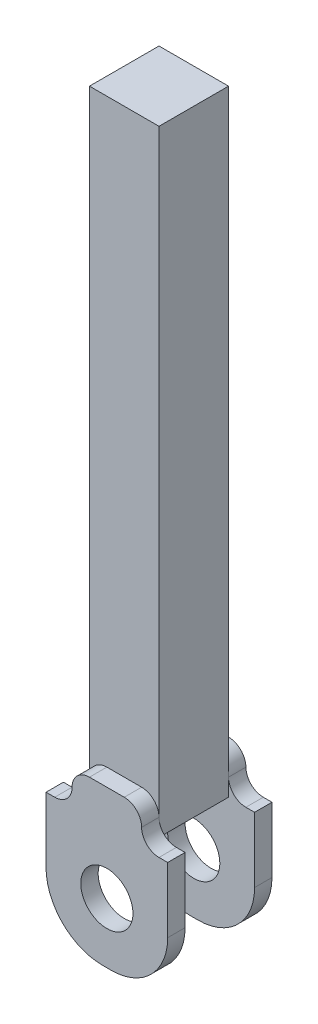
ISO-10303-21;
HEADER;
FILE_DESCRIPTION(('STEP AP214'),'2;1');
FILE_NAME('part.step','',(''),(''),'','','');
FILE_SCHEMA(('AUTOMOTIVE_DESIGN { 1 0 10303 214 1 1 1 1 }'));
ENDSEC;
DATA;
#1=APPLICATION_CONTEXT('core data for automotive mechanical design processes');
#2=APPLICATION_PROTOCOL_DEFINITION('international standard','automotive_design',2000,#1);
#3=PRODUCT_CONTEXT('',#1,'mechanical');
#4=PRODUCT('Part','Part','',(#3));
#5=PRODUCT_RELATED_PRODUCT_CATEGORY('part','',(#4));
#6=PRODUCT_DEFINITION_FORMATION('','',#4);
#7=PRODUCT_DEFINITION_CONTEXT('part definition',#1,'design');
#8=PRODUCT_DEFINITION('design','',#6,#7);
#9=PRODUCT_DEFINITION_SHAPE('','',#8);
#10=(LENGTH_UNIT() NAMED_UNIT(*) SI_UNIT(.MILLI.,.METRE.));
#11=(NAMED_UNIT(*) PLANE_ANGLE_UNIT() SI_UNIT($,.RADIAN.));
#12=(NAMED_UNIT(*) SI_UNIT($,.STERADIAN.) SOLID_ANGLE_UNIT());
#13=UNCERTAINTY_MEASURE_WITH_UNIT(LENGTH_MEASURE(1.E-05),#10,'distance_accuracy_value','');
#14=(GEOMETRIC_REPRESENTATION_CONTEXT(3) GLOBAL_UNCERTAINTY_ASSIGNED_CONTEXT((#13)) GLOBAL_UNIT_ASSIGNED_CONTEXT((#10,
#11,#12)) REPRESENTATION_CONTEXT('',''));
#15=CARTESIAN_POINT('',(0.,0.,0.));
#16=DIRECTION('',(0.,0.,1.));
#17=DIRECTION('',(1.,0.,0.));
#18=AXIS2_PLACEMENT_3D('',#15,#16,#17);
#19=CARTESIAN_POINT('',(-25.4,450.,25.4));
#20=DIRECTION('',(0.,0.,-1.));
#21=DIRECTION('',(-1.,0.,0.));
#22=AXIS2_PLACEMENT_3D('',#19,#20,#21);
#23=PLANE('',#22);
#24=DIRECTION('',(-1.,0.,0.));
#25=VECTOR('',#24,1.);
#26=CARTESIAN_POINT('',(-25.4,25.4,25.4));
#27=LINE('',#26,#25);
#28=CARTESIAN_POINT('',(12.7,25.4,25.4));
#29=VERTEX_POINT('',#28);
#30=CARTESIAN_POINT('',(-12.7,25.4,25.4));
#31=VERTEX_POINT('',#30);
#32=EDGE_CURVE('E315',#29,#31,#27,.T.);
#33=ORIENTED_EDGE('',*,*,#32,.F.);
#34=CARTESIAN_POINT('',(12.7,12.7,25.4));
#35=DIRECTION('',(0.,0.,-1.));
#36=DIRECTION('',(-1.,0.,0.));
#37=AXIS2_PLACEMENT_3D('',#34,#35,#36);
#38=CIRCLE('',#37,12.7);
#39=CARTESIAN_POINT('',(25.4,12.7,25.4));
#40=VERTEX_POINT('',#39);
#41=EDGE_CURVE('E392',#29,#40,#38,.T.);
#42=ORIENTED_EDGE('',*,*,#41,.T.);
#43=DIRECTION('',(0.,-1.,0.));
#44=VECTOR('',#43,1.);
#45=CARTESIAN_POINT('',(25.4,450.,25.4));
#46=LINE('',#45,#44);
#47=CARTESIAN_POINT('',(25.4,450.,25.4));
#48=VERTEX_POINT('',#47);
#49=EDGE_CURVE('E335',#48,#40,#46,.T.);
#50=ORIENTED_EDGE('',*,*,#49,.F.);
#51=DIRECTION('',(1.,0.,0.));
#52=VECTOR('',#51,1.);
#53=CARTESIAN_POINT('',(-25.4,450.,25.4));
#54=LINE('',#53,#52);
#55=CARTESIAN_POINT('',(-25.4,450.,25.4));
#56=VERTEX_POINT('',#55);
#57=EDGE_CURVE('E333',#56,#48,#54,.T.);
#58=ORIENTED_EDGE('',*,*,#57,.F.);
#59=DIRECTION('',(0.,-1.,0.));
#60=VECTOR('',#59,1.);
#61=CARTESIAN_POINT('',(-25.4,450.,25.4));
#62=LINE('',#61,#60);
#63=CARTESIAN_POINT('',(-25.4,12.7,25.4));
#64=VERTEX_POINT('',#63);
#65=EDGE_CURVE('E347',#56,#64,#62,.T.);
#66=ORIENTED_EDGE('',*,*,#65,.T.);
#67=CARTESIAN_POINT('',(-12.7,12.7,25.4));
#68=DIRECTION('',(0.,0.,-1.));
#69=DIRECTION('',(-1.,0.,0.));
#70=AXIS2_PLACEMENT_3D('',#67,#68,#69);
#71=CIRCLE('',#70,12.7);
#72=EDGE_CURVE('E404',#64,#31,#71,.T.);
#73=ORIENTED_EDGE('',*,*,#72,.T.);
#74=EDGE_LOOP('',(#33,#42,#50,#58,#66,#73));
#75=FACE_BOUND('',#74,.T.);
#76=ADVANCED_FACE('F37',(#75),#23,.F.);
#77=CARTESIAN_POINT('',(25.4,450.,25.4));
#78=DIRECTION('',(-1.,0.,0.));
#79=DIRECTION('',(0.,0.,1.));
#80=AXIS2_PLACEMENT_3D('',#77,#78,#79);
#81=PLANE('',#80);
#82=ORIENTED_EDGE('',*,*,#49,.T.);
#83=DIRECTION('',(0.,-1.,0.));
#84=VECTOR('',#83,1.);
#85=CARTESIAN_POINT('',(25.4,0.,25.4));
#86=LINE('',#85,#84);
#87=CARTESIAN_POINT('',(25.4,0.,25.4));
#88=VERTEX_POINT('',#87);
#89=EDGE_CURVE('E356',#40,#88,#86,.T.);
#90=ORIENTED_EDGE('',*,*,#89,.T.);
#91=DIRECTION('',(0.,0.,-1.));
#92=VECTOR('',#91,1.);
#93=CARTESIAN_POINT('',(25.4,0.,25.4));
#94=LINE('',#93,#92);
#95=CARTESIAN_POINT('',(25.4,0.,-25.4));
#96=VERTEX_POINT('',#95);
#97=EDGE_CURVE('E324',#88,#96,#94,.T.);
#98=ORIENTED_EDGE('',*,*,#97,.T.);
#99=DIRECTION('',(0.,1.,0.));
#100=VECTOR('',#99,1.);
#101=CARTESIAN_POINT('',(25.4,0.,-25.4));
#102=LINE('',#101,#100);
#103=CARTESIAN_POINT('',(25.4,12.7,-25.4));
#104=VERTEX_POINT('',#103);
#105=EDGE_CURVE('E353',#96,#104,#102,.T.);
#106=ORIENTED_EDGE('',*,*,#105,.T.);
#107=DIRECTION('',(0.,-1.,0.));
#108=VECTOR('',#107,1.);
#109=CARTESIAN_POINT('',(25.4,450.,-25.4));
#110=LINE('',#109,#108);
#111=CARTESIAN_POINT('',(25.4,450.,-25.4));
#112=VERTEX_POINT('',#111);
#113=EDGE_CURVE('E351',#112,#104,#110,.T.);
#114=ORIENTED_EDGE('',*,*,#113,.F.);
#115=DIRECTION('',(0.,0.,-1.));
#116=VECTOR('',#115,1.);
#117=CARTESIAN_POINT('',(25.4,450.,25.4));
#118=LINE('',#117,#116);
#119=EDGE_CURVE('E325',#48,#112,#118,.T.);
#120=ORIENTED_EDGE('',*,*,#119,.F.);
#121=EDGE_LOOP('',(#82,#90,#98,#106,#114,#120));
#122=FACE_BOUND('',#121,.T.);
#123=ADVANCED_FACE('F526',(#122),#81,.F.);
#124=CARTESIAN_POINT('',(-25.4,450.,-25.4));
#125=DIRECTION('',(0.,0.,1.));
#126=DIRECTION('',(1.,0.,0.));
#127=AXIS2_PLACEMENT_3D('',#124,#125,#126);
#128=PLANE('',#127);
#129=ORIENTED_EDGE('',*,*,#113,.T.);
#130=CARTESIAN_POINT('',(12.7,12.7,-25.4));
#131=DIRECTION('',(0.,0.,1.));
#132=DIRECTION('',(1.,0.,0.));
#133=AXIS2_PLACEMENT_3D('',#130,#131,#132);
#134=CIRCLE('',#133,12.7);
#135=CARTESIAN_POINT('',(12.7,25.4,-25.4));
#136=VERTEX_POINT('',#135);
#137=EDGE_CURVE('E390',#104,#136,#134,.T.);
#138=ORIENTED_EDGE('',*,*,#137,.T.);
#139=DIRECTION('',(-1.,0.,0.));
#140=VECTOR('',#139,1.);
#141=CARTESIAN_POINT('',(-25.4,25.4,-25.4));
#142=LINE('',#141,#140);
#143=CARTESIAN_POINT('',(-12.7,25.4,-25.4));
#144=VERTEX_POINT('',#143);
#145=EDGE_CURVE('E275',#136,#144,#142,.T.);
#146=ORIENTED_EDGE('',*,*,#145,.T.);
#147=CARTESIAN_POINT('',(-12.7,12.7,-25.4));
#148=DIRECTION('',(0.,0.,1.));
#149=DIRECTION('',(1.,0.,0.));
#150=AXIS2_PLACEMENT_3D('',#147,#148,#149);
#151=CIRCLE('',#150,12.7);
#152=CARTESIAN_POINT('',(-25.4,12.7,-25.4));
#153=VERTEX_POINT('',#152);
#154=EDGE_CURVE('E406',#144,#153,#151,.T.);
#155=ORIENTED_EDGE('',*,*,#154,.T.);
#156=DIRECTION('',(0.,-1.,0.));
#157=VECTOR('',#156,1.);
#158=CARTESIAN_POINT('',(-25.4,450.,-25.4));
#159=LINE('',#158,#157);
#160=CARTESIAN_POINT('',(-25.4,450.,-25.4));
#161=VERTEX_POINT('',#160);
#162=EDGE_CURVE('E349',#161,#153,#159,.T.);
#163=ORIENTED_EDGE('',*,*,#162,.F.);
#164=DIRECTION('',(-1.,0.,0.));
#165=VECTOR('',#164,1.);
#166=CARTESIAN_POINT('',(-25.4,450.,-25.4));
#167=LINE('',#166,#165);
#168=EDGE_CURVE('E328',#112,#161,#167,.T.);
#169=ORIENTED_EDGE('',*,*,#168,.F.);
#170=EDGE_LOOP('',(#129,#138,#146,#155,#163,#169));
#171=FACE_BOUND('',#170,.T.);
#172=ADVANCED_FACE('F531',(#171),#128,.F.);
#173=CARTESIAN_POINT('',(-25.4,450.,25.4));
#174=DIRECTION('',(1.,0.,0.));
#175=DIRECTION('',(0.,0.,-1.));
#176=AXIS2_PLACEMENT_3D('',#173,#174,#175);
#177=PLANE('',#176);
#178=ORIENTED_EDGE('',*,*,#162,.T.);
#179=DIRECTION('',(0.,-1.,0.));
#180=VECTOR('',#179,1.);
#181=CARTESIAN_POINT('',(-25.4,0.,-25.4));
#182=LINE('',#181,#180);
#183=CARTESIAN_POINT('',(-25.4,0.,-25.4));
#184=VERTEX_POINT('',#183);
#185=EDGE_CURVE('E385',#153,#184,#182,.T.);
#186=ORIENTED_EDGE('',*,*,#185,.T.);
#187=DIRECTION('',(0.,0.,1.));
#188=VECTOR('',#187,1.);
#189=CARTESIAN_POINT('',(-25.4,0.,25.4));
#190=LINE('',#189,#188);
#191=CARTESIAN_POINT('',(-25.4,0.,25.4));
#192=VERTEX_POINT('',#191);
#193=EDGE_CURVE('E341',#184,#192,#190,.T.);
#194=ORIENTED_EDGE('',*,*,#193,.T.);
#195=DIRECTION('',(0.,1.,0.));
#196=VECTOR('',#195,1.);
#197=CARTESIAN_POINT('',(-25.4,0.,25.4));
#198=LINE('',#197,#196);
#199=EDGE_CURVE('E382',#192,#64,#198,.T.);
#200=ORIENTED_EDGE('',*,*,#199,.T.);
#201=ORIENTED_EDGE('',*,*,#65,.F.);
#202=DIRECTION('',(0.,0.,1.));
#203=VECTOR('',#202,1.);
#204=CARTESIAN_POINT('',(-25.4,450.,25.4));
#205=LINE('',#204,#203);
#206=EDGE_CURVE('E331',#161,#56,#205,.T.);
#207=ORIENTED_EDGE('',*,*,#206,.F.);
#208=EDGE_LOOP('',(#178,#186,#194,#200,#201,#207));
#209=FACE_BOUND('',#208,.T.);
#210=ADVANCED_FACE('F538',(#209),#177,.F.);
#211=CARTESIAN_POINT('',(0.,450.,0.));
#212=DIRECTION('',(0.,-1.,0.));
#213=DIRECTION('',(0.,0.,-1.));
#214=AXIS2_PLACEMENT_3D('',#211,#212,#213);
#215=PLANE('',#214);
#216=ORIENTED_EDGE('',*,*,#119,.T.);
#217=ORIENTED_EDGE('',*,*,#168,.T.);
#218=ORIENTED_EDGE('',*,*,#206,.T.);
#219=ORIENTED_EDGE('',*,*,#57,.T.);
#220=EDGE_LOOP('',(#216,#217,#218,#219));
#221=FACE_BOUND('',#220,.T.);
#222=ADVANCED_FACE('F541',(#221),#215,.F.);
#223=CARTESIAN_POINT('',(0.,0.,0.));
#224=DIRECTION('',(0.,-1.,0.));
#225=DIRECTION('',(0.,0.,-1.));
#226=AXIS2_PLACEMENT_3D('',#223,#224,#225);
#227=PLANE('',#226);
#228=ORIENTED_EDGE('',*,*,#97,.F.);
#229=DIRECTION('',(1.,0.,0.));
#230=VECTOR('',#229,1.);
#231=CARTESIAN_POINT('',(-25.4,0.,25.4));
#232=LINE('',#231,#230);
#233=EDGE_CURVE('E329',#192,#88,#232,.T.);
#234=ORIENTED_EDGE('',*,*,#233,.F.);
#235=ORIENTED_EDGE('',*,*,#193,.F.);
#236=DIRECTION('',(-1.,0.,0.));
#237=VECTOR('',#236,1.);
#238=CARTESIAN_POINT('',(-25.4,0.,-25.4));
#239=LINE('',#238,#237);
#240=EDGE_CURVE('E338',#96,#184,#239,.T.);
#241=ORIENTED_EDGE('',*,*,#240,.F.);
#242=EDGE_LOOP('',(#228,#234,#235,#241));
#243=FACE_BOUND('',#242,.T.);
#244=ADVANCED_FACE('F536',(#243),#227,.T.);
#245=CARTESIAN_POINT('',(0.,0.,25.4));
#246=DIRECTION('',(0.,0.,1.));
#247=DIRECTION('',(1.,0.,0.));
#248=AXIS2_PLACEMENT_3D('',#245,#246,#247);
#249=PLANE('',#248);
#250=CARTESIAN_POINT('',(0.,-45.,25.4));
#251=DIRECTION('',(0.,0.,1.));
#252=DIRECTION('',(1.,0.,0.));
#253=AXIS2_PLACEMENT_3D('',#250,#251,#252);
#254=CIRCLE('',#253,19.05);
#255=CARTESIAN_POINT('',(19.05,-45.,25.4));
#256=VERTEX_POINT('',#255);
#257=EDGE_CURVE('E245',#256,#256,#254,.T.);
#258=ORIENTED_EDGE('',*,*,#257,.T.);
#259=EDGE_LOOP('',(#258));
#260=FACE_BOUND('',#259,.T.);
#261=DIRECTION('',(1.,0.,0.));
#262=VECTOR('',#261,1.);
#263=CARTESIAN_POINT('',(-44.45,-88.9,25.4));
#264=LINE('',#263,#262);
#265=CARTESIAN_POINT('',(-3.17500000000001,-88.9,25.4));
#266=VERTEX_POINT('',#265);
#267=CARTESIAN_POINT('',(3.17500000000001,-88.9,25.4));
#268=VERTEX_POINT('',#267);
#269=EDGE_CURVE('E307',#266,#268,#264,.T.);
#270=ORIENTED_EDGE('',*,*,#269,.F.);
#271=CARTESIAN_POINT('',(-3.17500000000001,-47.625,25.4));
#272=DIRECTION('',(0.,0.,1.));
#273=DIRECTION('',(1.,0.,0.));
#274=AXIS2_PLACEMENT_3D('',#271,#272,#273);
#275=CIRCLE('',#274,41.275);
#276=CARTESIAN_POINT('',(-44.45,-47.625,25.4));
#277=VERTEX_POINT('',#276);
#278=EDGE_CURVE('E451',#266,#277,#275,.F.);
#279=ORIENTED_EDGE('',*,*,#278,.T.);
#280=DIRECTION('',(0.,-1.,0.));
#281=VECTOR('',#280,1.);
#282=CARTESIAN_POINT('',(-44.45,0.,25.4));
#283=LINE('',#282,#281);
#284=CARTESIAN_POINT('',(-44.45,0.,25.4));
#285=VERTEX_POINT('',#284);
#286=EDGE_CURVE('E287',#285,#277,#283,.T.);
#287=ORIENTED_EDGE('',*,*,#286,.F.);
#288=DIRECTION('',(-1.,0.,0.));
#289=VECTOR('',#288,1.);
#290=CARTESIAN_POINT('',(-44.45,0.,25.4));
#291=LINE('',#290,#289);
#292=CARTESIAN_POINT('',(-38.1,0.,25.4));
#293=VERTEX_POINT('',#292);
#294=EDGE_CURVE('E293',#293,#285,#291,.T.);
#295=ORIENTED_EDGE('',*,*,#294,.F.);
#296=CARTESIAN_POINT('',(-38.1,12.7,25.4));
#297=DIRECTION('',(0.,0.,1.));
#298=DIRECTION('',(1.,0.,0.));
#299=AXIS2_PLACEMENT_3D('',#296,#297,#298);
#300=CIRCLE('',#299,12.7);
#301=EDGE_CURVE('E413',#293,#64,#300,.T.);
#302=ORIENTED_EDGE('',*,*,#301,.T.);
#303=ORIENTED_EDGE('',*,*,#199,.F.);
#304=ORIENTED_EDGE('',*,*,#233,.T.);
#305=ORIENTED_EDGE('',*,*,#89,.F.);
#306=CARTESIAN_POINT('',(38.1,12.7,25.4));
#307=DIRECTION('',(0.,0.,1.));
#308=DIRECTION('',(1.,0.,0.));
#309=AXIS2_PLACEMENT_3D('',#306,#307,#308);
#310=CIRCLE('',#309,12.7);
#311=CARTESIAN_POINT('',(38.1,0.,25.4));
#312=VERTEX_POINT('',#311);
#313=EDGE_CURVE('E395',#40,#312,#310,.T.);
#314=ORIENTED_EDGE('',*,*,#313,.T.);
#315=DIRECTION('',(-1.,0.,0.));
#316=VECTOR('',#315,1.);
#317=CARTESIAN_POINT('',(25.4,0.,25.4));
#318=LINE('',#317,#316);
#319=CARTESIAN_POINT('',(44.45,0.,25.4));
#320=VERTEX_POINT('',#319);
#321=EDGE_CURVE('E312',#320,#312,#318,.T.);
#322=ORIENTED_EDGE('',*,*,#321,.F.);
#323=DIRECTION('',(0.,1.,0.));
#324=VECTOR('',#323,1.);
#325=CARTESIAN_POINT('',(44.45,0.,25.4));
#326=LINE('',#325,#324);
#327=CARTESIAN_POINT('',(44.45,-47.625,25.4));
#328=VERTEX_POINT('',#327);
#329=EDGE_CURVE('E310',#328,#320,#326,.T.);
#330=ORIENTED_EDGE('',*,*,#329,.F.);
#331=CARTESIAN_POINT('',(3.17500000000001,-47.625,25.4));
#332=DIRECTION('',(0.,0.,1.));
#333=DIRECTION('',(1.,0.,0.));
#334=AXIS2_PLACEMENT_3D('',#331,#332,#333);
#335=CIRCLE('',#334,41.275);
#336=EDGE_CURVE('E449',#328,#268,#335,.F.);
#337=ORIENTED_EDGE('',*,*,#336,.T.);
#338=EDGE_LOOP('',(#270,#279,#287,#295,#302,#303,#304,#305,#314,#322,#330,#337));
#339=FACE_BOUND('',#338,.T.);
#340=ADVANCED_FACE('F466',(#260,#339),#249,.F.);
#341=CARTESIAN_POINT('',(0.,0.,38.1));
#342=DIRECTION('',(0.,0.,1.));
#343=DIRECTION('',(1.,0.,0.));
#344=AXIS2_PLACEMENT_3D('',#341,#342,#343);
#345=PLANE('',#344);
#346=DIRECTION('',(0.,-1.,0.));
#347=VECTOR('',#346,1.);
#348=CARTESIAN_POINT('',(-44.45,0.,38.1));
#349=LINE('',#348,#347);
#350=CARTESIAN_POINT('',(-44.45,0.,38.1));
#351=VERTEX_POINT('',#350);
#352=CARTESIAN_POINT('',(-44.45,-47.625,38.1));
#353=VERTEX_POINT('',#352);
#354=EDGE_CURVE('E290',#351,#353,#349,.T.);
#355=ORIENTED_EDGE('',*,*,#354,.T.);
#356=CARTESIAN_POINT('',(-3.17500000000001,-47.625,38.1));
#357=DIRECTION('',(0.,0.,1.));
#358=DIRECTION('',(1.,0.,0.));
#359=AXIS2_PLACEMENT_3D('',#356,#357,#358);
#360=CIRCLE('',#359,41.275);
#361=CARTESIAN_POINT('',(-3.17500000000001,-88.9,38.1));
#362=VERTEX_POINT('',#361);
#363=EDGE_CURVE('E455',#353,#362,#360,.T.);
#364=ORIENTED_EDGE('',*,*,#363,.T.);
#365=DIRECTION('',(1.,0.,0.));
#366=VECTOR('',#365,1.);
#367=CARTESIAN_POINT('',(-44.45,-88.9,38.1));
#368=LINE('',#367,#366);
#369=CARTESIAN_POINT('',(3.17500000000001,-88.9,38.1));
#370=VERTEX_POINT('',#369);
#371=EDGE_CURVE('E292',#362,#370,#368,.T.);
#372=ORIENTED_EDGE('',*,*,#371,.T.);
#373=CARTESIAN_POINT('',(3.17500000000001,-47.625,38.1));
#374=DIRECTION('',(0.,0.,1.));
#375=DIRECTION('',(1.,0.,0.));
#376=AXIS2_PLACEMENT_3D('',#373,#374,#375);
#377=CIRCLE('',#376,41.275);
#378=CARTESIAN_POINT('',(44.45,-47.625,38.1));
#379=VERTEX_POINT('',#378);
#380=EDGE_CURVE('E52',#370,#379,#377,.T.);
#381=ORIENTED_EDGE('',*,*,#380,.T.);
#382=DIRECTION('',(0.,1.,0.));
#383=VECTOR('',#382,1.);
#384=CARTESIAN_POINT('',(44.45,0.,38.1));
#385=LINE('',#384,#383);
#386=CARTESIAN_POINT('',(44.45,0.,38.1));
#387=VERTEX_POINT('',#386);
#388=EDGE_CURVE('E295',#379,#387,#385,.T.);
#389=ORIENTED_EDGE('',*,*,#388,.T.);
#390=DIRECTION('',(-1.,0.,0.));
#391=VECTOR('',#390,1.);
#392=CARTESIAN_POINT('',(25.4,0.,38.1));
#393=LINE('',#392,#391);
#394=CARTESIAN_POINT('',(38.1,0.,38.1));
#395=VERTEX_POINT('',#394);
#396=EDGE_CURVE('E297',#387,#395,#393,.T.);
#397=ORIENTED_EDGE('',*,*,#396,.T.);
#398=CARTESIAN_POINT('',(38.1,12.7,38.1));
#399=DIRECTION('',(0.,0.,1.));
#400=DIRECTION('',(1.,0.,0.));
#401=AXIS2_PLACEMENT_3D('',#398,#399,#400);
#402=CIRCLE('',#401,12.7);
#403=CARTESIAN_POINT('',(25.4,12.7,38.1));
#404=VERTEX_POINT('',#403);
#405=EDGE_CURVE('E397',#395,#404,#402,.F.);
#406=ORIENTED_EDGE('',*,*,#405,.T.);
#407=CARTESIAN_POINT('',(12.7,12.7,38.1));
#408=DIRECTION('',(0.,0.,1.));
#409=DIRECTION('',(1.,0.,0.));
#410=AXIS2_PLACEMENT_3D('',#407,#408,#409);
#411=CIRCLE('',#410,12.7);
#412=CARTESIAN_POINT('',(12.7,25.4,38.1));
#413=VERTEX_POINT('',#412);
#414=EDGE_CURVE('E376',#404,#413,#411,.T.);
#415=ORIENTED_EDGE('',*,*,#414,.T.);
#416=DIRECTION('',(-1.,0.,0.));
#417=VECTOR('',#416,1.);
#418=CARTESIAN_POINT('',(-25.4,25.4,38.1));
#419=LINE('',#418,#417);
#420=CARTESIAN_POINT('',(-12.7,25.4,38.1));
#421=VERTEX_POINT('',#420);
#422=EDGE_CURVE('E300',#413,#421,#419,.T.);
#423=ORIENTED_EDGE('',*,*,#422,.T.);
#424=CARTESIAN_POINT('',(-12.7,12.7,38.1));
#425=DIRECTION('',(0.,0.,1.));
#426=DIRECTION('',(1.,0.,0.));
#427=AXIS2_PLACEMENT_3D('',#424,#425,#426);
#428=CIRCLE('',#427,12.7);
#429=CARTESIAN_POINT('',(-25.4,12.7,38.1));
#430=VERTEX_POINT('',#429);
#431=EDGE_CURVE('E374',#421,#430,#428,.T.);
#432=ORIENTED_EDGE('',*,*,#431,.T.);
#433=CARTESIAN_POINT('',(-38.1,12.7,38.1));
#434=DIRECTION('',(0.,0.,1.));
#435=DIRECTION('',(1.,0.,0.));
#436=AXIS2_PLACEMENT_3D('',#433,#434,#435);
#437=CIRCLE('',#436,12.7);
#438=CARTESIAN_POINT('',(-38.1,0.,38.1));
#439=VERTEX_POINT('',#438);
#440=EDGE_CURVE('E416',#430,#439,#437,.F.);
#441=ORIENTED_EDGE('',*,*,#440,.T.);
#442=DIRECTION('',(-1.,0.,0.));
#443=VECTOR('',#442,1.);
#444=CARTESIAN_POINT('',(-44.45,0.,38.1));
#445=LINE('',#444,#443);
#446=EDGE_CURVE('E303',#439,#351,#445,.T.);
#447=ORIENTED_EDGE('',*,*,#446,.T.);
#448=EDGE_LOOP('',(#355,#364,#372,#381,#389,#397,#406,#415,#423,#432,#441,#447));
#449=FACE_BOUND('',#448,.T.);
#450=CARTESIAN_POINT('',(0.,-45.,38.1));
#451=DIRECTION('',(0.,0.,1.));
#452=DIRECTION('',(1.,0.,0.));
#453=AXIS2_PLACEMENT_3D('',#450,#451,#452);
#454=CIRCLE('',#453,19.05);
#455=CARTESIAN_POINT('',(19.05,-45.,38.1));
#456=VERTEX_POINT('',#455);
#457=EDGE_CURVE('E284',#456,#456,#454,.T.);
#458=ORIENTED_EDGE('',*,*,#457,.F.);
#459=EDGE_LOOP('',(#458));
#460=FACE_BOUND('',#459,.T.);
#461=ADVANCED_FACE('F478',(#449,#460),#345,.T.);
#462=CARTESIAN_POINT('',(-44.45,0.,38.1));
#463=DIRECTION('',(1.,0.,0.));
#464=DIRECTION('',(0.,1.,0.));
#465=AXIS2_PLACEMENT_3D('',#462,#463,#464);
#466=PLANE('',#465);
#467=ORIENTED_EDGE('',*,*,#286,.T.);
#468=DIRECTION('',(0.,0.,-1.));
#469=VECTOR('',#468,1.);
#470=CARTESIAN_POINT('',(-44.45,-47.625,38.1));
#471=LINE('',#470,#469);
#472=EDGE_CURVE('E60',#277,#353,#471,.F.);
#473=ORIENTED_EDGE('',*,*,#472,.T.);
#474=ORIENTED_EDGE('',*,*,#354,.F.);
#475=DIRECTION('',(0.,0.,-1.));
#476=VECTOR('',#475,1.);
#477=CARTESIAN_POINT('',(-44.45,0.,38.1));
#478=LINE('',#477,#476);
#479=EDGE_CURVE('E305',#351,#285,#478,.T.);
#480=ORIENTED_EDGE('',*,*,#479,.T.);
#481=EDGE_LOOP('',(#467,#473,#474,#480));
#482=FACE_BOUND('',#481,.T.);
#483=ADVANCED_FACE('F507',(#482),#466,.F.);
#484=CARTESIAN_POINT('',(-44.45,-88.9,38.1));
#485=DIRECTION('',(0.,1.,0.));
#486=DIRECTION('',(0.,0.,1.));
#487=AXIS2_PLACEMENT_3D('',#484,#485,#486);
#488=PLANE('',#487);
#489=ORIENTED_EDGE('',*,*,#371,.F.);
#490=DIRECTION('',(0.,0.,-1.));
#491=VECTOR('',#490,1.);
#492=CARTESIAN_POINT('',(-3.17500000000001,-88.9,38.1));
#493=LINE('',#492,#491);
#494=EDGE_CURVE('E446',#362,#266,#493,.T.);
#495=ORIENTED_EDGE('',*,*,#494,.T.);
#496=ORIENTED_EDGE('',*,*,#269,.T.);
#497=DIRECTION('',(0.,0.,-1.));
#498=VECTOR('',#497,1.);
#499=CARTESIAN_POINT('',(3.17500000000001,-88.9,38.1));
#500=LINE('',#499,#498);
#501=EDGE_CURVE('E444',#268,#370,#500,.F.);
#502=ORIENTED_EDGE('',*,*,#501,.T.);
#503=EDGE_LOOP('',(#489,#495,#496,#502));
#504=FACE_BOUND('',#503,.T.);
#505=ADVANCED_FACE('F514',(#504),#488,.F.);
#506=CARTESIAN_POINT('',(44.45,0.,38.1));
#507=DIRECTION('',(-1.,0.,0.));
#508=DIRECTION('',(0.,-1.,0.));
#509=AXIS2_PLACEMENT_3D('',#506,#507,#508);
#510=PLANE('',#509);
#511=ORIENTED_EDGE('',*,*,#388,.F.);
#512=DIRECTION('',(0.,0.,-1.));
#513=VECTOR('',#512,1.);
#514=CARTESIAN_POINT('',(44.45,-47.625,38.1));
#515=LINE('',#514,#513);
#516=EDGE_CURVE('E45',#379,#328,#515,.T.);
#517=ORIENTED_EDGE('',*,*,#516,.T.);
#518=ORIENTED_EDGE('',*,*,#329,.T.);
#519=DIRECTION('',(0.,0.,-1.));
#520=VECTOR('',#519,1.);
#521=CARTESIAN_POINT('',(44.45,0.,38.1));
#522=LINE('',#521,#520);
#523=EDGE_CURVE('E321',#387,#320,#522,.T.);
#524=ORIENTED_EDGE('',*,*,#523,.F.);
#525=EDGE_LOOP('',(#511,#517,#518,#524));
#526=FACE_BOUND('',#525,.T.);
#527=ADVANCED_FACE('F460',(#526),#510,.F.);
#528=CARTESIAN_POINT('',(25.4,0.,38.1));
#529=DIRECTION('',(0.,-1.,0.));
#530=DIRECTION('',(0.,0.,-1.));
#531=AXIS2_PLACEMENT_3D('',#528,#529,#530);
#532=PLANE('',#531);
#533=ORIENTED_EDGE('',*,*,#321,.T.);
#534=DIRECTION('',(0.,0.,-1.));
#535=VECTOR('',#534,1.);
#536=CARTESIAN_POINT('',(38.1,0.,38.1));
#537=LINE('',#536,#535);
#538=EDGE_CURVE('E378',#312,#395,#537,.F.);
#539=ORIENTED_EDGE('',*,*,#538,.T.);
#540=ORIENTED_EDGE('',*,*,#396,.F.);
#541=ORIENTED_EDGE('',*,*,#523,.T.);
#542=EDGE_LOOP('',(#533,#539,#540,#541));
#543=FACE_BOUND('',#542,.T.);
#544=ADVANCED_FACE('F471',(#543),#532,.F.);
#545=CARTESIAN_POINT('',(-25.4,25.4,38.1));
#546=DIRECTION('',(0.,-1.,0.));
#547=DIRECTION('',(0.,0.,-1.));
#548=AXIS2_PLACEMENT_3D('',#545,#546,#547);
#549=PLANE('',#548);
#550=ORIENTED_EDGE('',*,*,#422,.F.);
#551=DIRECTION('',(0.,0.,-1.));
#552=VECTOR('',#551,1.);
#553=CARTESIAN_POINT('',(12.7,25.4,38.1));
#554=LINE('',#553,#552);
#555=EDGE_CURVE('E371',#413,#29,#554,.T.);
#556=ORIENTED_EDGE('',*,*,#555,.T.);
#557=ORIENTED_EDGE('',*,*,#32,.T.);
#558=DIRECTION('',(0.,0.,-1.));
#559=VECTOR('',#558,1.);
#560=CARTESIAN_POINT('',(-12.7,25.4,38.1));
#561=LINE('',#560,#559);
#562=EDGE_CURVE('E368',#31,#421,#561,.F.);
#563=ORIENTED_EDGE('',*,*,#562,.T.);
#564=EDGE_LOOP('',(#550,#556,#557,#563));
#565=FACE_BOUND('',#564,.T.);
#566=ADVANCED_FACE('F484',(#565),#549,.F.);
#567=CARTESIAN_POINT('',(-44.45,0.,38.1));
#568=DIRECTION('',(0.,-1.,0.));
#569=DIRECTION('',(0.,0.,-1.));
#570=AXIS2_PLACEMENT_3D('',#567,#568,#569);
#571=PLANE('',#570);
#572=ORIENTED_EDGE('',*,*,#446,.F.);
#573=DIRECTION('',(0.,0.,-1.));
#574=VECTOR('',#573,1.);
#575=CARTESIAN_POINT('',(-38.1,0.,25.4));
#576=LINE('',#575,#574);
#577=EDGE_CURVE('E388',#439,#293,#576,.T.);
#578=ORIENTED_EDGE('',*,*,#577,.T.);
#579=ORIENTED_EDGE('',*,*,#294,.T.);
#580=ORIENTED_EDGE('',*,*,#479,.F.);
#581=EDGE_LOOP('',(#572,#578,#579,#580));
#582=FACE_BOUND('',#581,.T.);
#583=ADVANCED_FACE('F504',(#582),#571,.F.);
#584=CARTESIAN_POINT('',(0.,-45.,38.1));
#585=DIRECTION('',(0.,0.,-1.));
#586=DIRECTION('',(-1.,0.,0.));
#587=AXIS2_PLACEMENT_3D('',#584,#585,#586);
#588=CYLINDRICAL_SURFACE('',#587,19.05);
#589=ORIENTED_EDGE('',*,*,#457,.T.);
#590=EDGE_LOOP('',(#589));
#591=FACE_BOUND('',#590,.T.);
#592=ORIENTED_EDGE('',*,*,#257,.F.);
#593=EDGE_LOOP('',(#592));
#594=FACE_BOUND('',#593,.T.);
#595=ADVANCED_FACE('F629',(#591,#594),#588,.F.);
#596=CARTESIAN_POINT('',(0.,0.,-25.4));
#597=DIRECTION('',(0.,0.,-1.));
#598=DIRECTION('',(1.,0.,0.));
#599=AXIS2_PLACEMENT_3D('',#596,#597,#598);
#600=PLANE('',#599);
#601=CARTESIAN_POINT('',(0.,-45.,-25.4));
#602=DIRECTION('',(0.,0.,1.));
#603=DIRECTION('',(1.,0.,0.));
#604=AXIS2_PLACEMENT_3D('',#601,#602,#603);
#605=CIRCLE('',#604,19.05);
#606=CARTESIAN_POINT('',(19.05,-45.,-25.4));
#607=VERTEX_POINT('',#606);
#608=EDGE_CURVE('E258',#607,#607,#605,.T.);
#609=ORIENTED_EDGE('',*,*,#608,.F.);
#610=EDGE_LOOP('',(#609));
#611=FACE_BOUND('',#610,.T.);
#612=DIRECTION('',(0.,-1.,0.));
#613=VECTOR('',#612,1.);
#614=CARTESIAN_POINT('',(-44.45,0.,-25.4));
#615=LINE('',#614,#613);
#616=CARTESIAN_POINT('',(-44.45,0.,-25.4));
#617=VERTEX_POINT('',#616);
#618=CARTESIAN_POINT('',(-44.45,-47.625,-25.4));
#619=VERTEX_POINT('',#618);
#620=EDGE_CURVE('E244',#617,#619,#615,.T.);
#621=ORIENTED_EDGE('',*,*,#620,.T.);
#622=CARTESIAN_POINT('',(-3.17500000000001,-47.625,-25.4));
#623=DIRECTION('',(0.,0.,-1.));
#624=DIRECTION('',(-1.,0.,0.));
#625=AXIS2_PLACEMENT_3D('',#622,#623,#624);
#626=CIRCLE('',#625,41.275);
#627=CARTESIAN_POINT('',(-3.17500000000001,-88.9,-25.4));
#628=VERTEX_POINT('',#627);
#629=EDGE_CURVE('E434',#619,#628,#626,.F.);
#630=ORIENTED_EDGE('',*,*,#629,.T.);
#631=DIRECTION('',(1.,0.,0.));
#632=VECTOR('',#631,1.);
#633=CARTESIAN_POINT('',(-44.45,-88.9,-25.4));
#634=LINE('',#633,#632);
#635=CARTESIAN_POINT('',(3.17500000000001,-88.9,-25.4));
#636=VERTEX_POINT('',#635);
#637=EDGE_CURVE('E252',#628,#636,#634,.T.);
#638=ORIENTED_EDGE('',*,*,#637,.T.);
#639=CARTESIAN_POINT('',(3.17500000000001,-47.625,-25.4));
#640=DIRECTION('',(0.,0.,-1.));
#641=DIRECTION('',(-1.,0.,0.));
#642=AXIS2_PLACEMENT_3D('',#639,#640,#641);
#643=CIRCLE('',#642,41.275);
#644=CARTESIAN_POINT('',(44.45,-47.625,-25.4));
#645=VERTEX_POINT('',#644);
#646=EDGE_CURVE('E432',#636,#645,#643,.F.);
#647=ORIENTED_EDGE('',*,*,#646,.T.);
#648=DIRECTION('',(0.,1.,0.));
#649=VECTOR('',#648,1.);
#650=CARTESIAN_POINT('',(44.45,0.,-25.4));
#651=LINE('',#650,#649);
#652=CARTESIAN_POINT('',(44.45,0.,-25.4));
#653=VERTEX_POINT('',#652);
#654=EDGE_CURVE('E255',#645,#653,#651,.T.);
#655=ORIENTED_EDGE('',*,*,#654,.T.);
#656=DIRECTION('',(-1.,0.,0.));
#657=VECTOR('',#656,1.);
#658=CARTESIAN_POINT('',(25.4,0.,-25.4));
#659=LINE('',#658,#657);
#660=CARTESIAN_POINT('',(38.1,0.,-25.4));
#661=VERTEX_POINT('',#660);
#662=EDGE_CURVE('E278',#653,#661,#659,.T.);
#663=ORIENTED_EDGE('',*,*,#662,.T.);
#664=CARTESIAN_POINT('',(38.1,12.7,-25.4));
#665=DIRECTION('',(0.,0.,-1.));
#666=DIRECTION('',(-1.,0.,0.));
#667=AXIS2_PLACEMENT_3D('',#664,#665,#666);
#668=CIRCLE('',#667,12.7);
#669=EDGE_CURVE('E399',#661,#104,#668,.T.);
#670=ORIENTED_EDGE('',*,*,#669,.T.);
#671=ORIENTED_EDGE('',*,*,#105,.F.);
#672=ORIENTED_EDGE('',*,*,#240,.T.);
#673=ORIENTED_EDGE('',*,*,#185,.F.);
#674=CARTESIAN_POINT('',(-38.1,12.7,-25.4));
#675=DIRECTION('',(0.,0.,-1.));
#676=DIRECTION('',(-1.,0.,0.));
#677=AXIS2_PLACEMENT_3D('',#674,#675,#676);
#678=CIRCLE('',#677,12.7);
#679=CARTESIAN_POINT('',(-38.1,0.,-25.4));
#680=VERTEX_POINT('',#679);
#681=EDGE_CURVE('E409',#153,#680,#678,.T.);
#682=ORIENTED_EDGE('',*,*,#681,.T.);
#683=DIRECTION('',(-1.,0.,0.));
#684=VECTOR('',#683,1.);
#685=CARTESIAN_POINT('',(-44.45,0.,-25.4));
#686=LINE('',#685,#684);
#687=EDGE_CURVE('E272',#680,#617,#686,.T.);
#688=ORIENTED_EDGE('',*,*,#687,.T.);
#689=EDGE_LOOP('',(#621,#630,#638,#647,#655,#663,#670,#671,#672,#673,#682,#688));
#690=FACE_BOUND('',#689,.T.);
#691=ADVANCED_FACE('F577',(#611,#690),#600,.F.);
#692=CARTESIAN_POINT('',(-44.45,0.,-38.1));
#693=DIRECTION('',(-1.,0.,0.));
#694=DIRECTION('',(0.,-1.,0.));
#695=AXIS2_PLACEMENT_3D('',#692,#693,#694);
#696=PLANE('',#695);
#697=DIRECTION('',(0.,-1.,0.));
#698=VECTOR('',#697,1.);
#699=CARTESIAN_POINT('',(-44.45,0.,-38.1));
#700=LINE('',#699,#698);
#701=CARTESIAN_POINT('',(-44.45,0.,-38.1));
#702=VERTEX_POINT('',#701);
#703=CARTESIAN_POINT('',(-44.45,-47.625,-38.1));
#704=VERTEX_POINT('',#703);
#705=EDGE_CURVE('E236',#702,#704,#700,.T.);
#706=ORIENTED_EDGE('',*,*,#705,.T.);
#707=DIRECTION('',(0.,0.,1.));
#708=VECTOR('',#707,1.);
#709=CARTESIAN_POINT('',(-44.45,-47.625,-38.1));
#710=LINE('',#709,#708);
#711=EDGE_CURVE('E418',#704,#619,#710,.T.);
#712=ORIENTED_EDGE('',*,*,#711,.T.);
#713=ORIENTED_EDGE('',*,*,#620,.F.);
#714=DIRECTION('',(0.,0.,1.));
#715=VECTOR('',#714,1.);
#716=CARTESIAN_POINT('',(-44.45,0.,-38.1));
#717=LINE('',#716,#715);
#718=EDGE_CURVE('E228',#702,#617,#717,.T.);
#719=ORIENTED_EDGE('',*,*,#718,.F.);
#720=EDGE_LOOP('',(#706,#712,#713,#719));
#721=FACE_BOUND('',#720,.T.);
#722=ADVANCED_FACE('F240',(#721),#696,.T.);
#723=CARTESIAN_POINT('',(-44.45,0.,-38.1));
#724=DIRECTION('',(0.,1.,0.));
#725=DIRECTION('',(0.,0.,1.));
#726=AXIS2_PLACEMENT_3D('',#723,#724,#725);
#727=PLANE('',#726);
#728=ORIENTED_EDGE('',*,*,#687,.F.);
#729=DIRECTION('',(0.,0.,1.));
#730=VECTOR('',#729,1.);
#731=CARTESIAN_POINT('',(-38.1,0.,-38.1));
#732=LINE('',#731,#730);
#733=CARTESIAN_POINT('',(-38.1,0.,-38.1));
#734=VERTEX_POINT('',#733);
#735=EDGE_CURVE('E231',#680,#734,#732,.F.);
#736=ORIENTED_EDGE('',*,*,#735,.T.);
#737=DIRECTION('',(-1.,0.,0.));
#738=VECTOR('',#737,1.);
#739=CARTESIAN_POINT('',(-44.45,0.,-38.1));
#740=LINE('',#739,#738);
#741=EDGE_CURVE('E224',#734,#702,#740,.T.);
#742=ORIENTED_EDGE('',*,*,#741,.T.);
#743=ORIENTED_EDGE('',*,*,#718,.T.);
#744=EDGE_LOOP('',(#728,#736,#742,#743));
#745=FACE_BOUND('',#744,.T.);
#746=ADVANCED_FACE('F227',(#745),#727,.T.);
#747=CARTESIAN_POINT('',(-25.4,25.4,-38.1));
#748=DIRECTION('',(0.,1.,0.));
#749=DIRECTION('',(0.,0.,1.));
#750=AXIS2_PLACEMENT_3D('',#747,#748,#749);
#751=PLANE('',#750);
#752=ORIENTED_EDGE('',*,*,#145,.F.);
#753=DIRECTION('',(0.,0.,1.));
#754=VECTOR('',#753,1.);
#755=CARTESIAN_POINT('',(12.7,25.4,-38.1));
#756=LINE('',#755,#754);
#757=CARTESIAN_POINT('',(12.7,25.4,-38.1));
#758=VERTEX_POINT('',#757);
#759=EDGE_CURVE('E361',#136,#758,#756,.F.);
#760=ORIENTED_EDGE('',*,*,#759,.T.);
#761=DIRECTION('',(-1.,0.,0.));
#762=VECTOR('',#761,1.);
#763=CARTESIAN_POINT('',(-25.4,25.4,-38.1));
#764=LINE('',#763,#762);
#765=CARTESIAN_POINT('',(-12.7,25.4,-38.1));
#766=VERTEX_POINT('',#765);
#767=EDGE_CURVE('E235',#758,#766,#764,.T.);
#768=ORIENTED_EDGE('',*,*,#767,.T.);
#769=DIRECTION('',(0.,0.,1.));
#770=VECTOR('',#769,1.);
#771=CARTESIAN_POINT('',(-12.7,25.4,-25.4));
#772=LINE('',#771,#770);
#773=EDGE_CURVE('E358',#766,#144,#772,.T.);
#774=ORIENTED_EDGE('',*,*,#773,.T.);
#775=EDGE_LOOP('',(#752,#760,#768,#774));
#776=FACE_BOUND('',#775,.T.);
#777=ADVANCED_FACE('F587',(#776),#751,.T.);
#778=CARTESIAN_POINT('',(25.4,0.,-38.1));
#779=DIRECTION('',(0.,1.,0.));
#780=DIRECTION('',(0.,0.,1.));
#781=AXIS2_PLACEMENT_3D('',#778,#779,#780);
#782=PLANE('',#781);
#783=DIRECTION('',(-1.,0.,0.));
#784=VECTOR('',#783,1.);
#785=CARTESIAN_POINT('',(25.4,0.,-38.1));
#786=LINE('',#785,#784);
#787=CARTESIAN_POINT('',(44.45,0.,-38.1));
#788=VERTEX_POINT('',#787);
#789=CARTESIAN_POINT('',(38.1,0.,-38.1));
#790=VERTEX_POINT('',#789);
#791=EDGE_CURVE('E263',#788,#790,#786,.T.);
#792=ORIENTED_EDGE('',*,*,#791,.T.);
#793=DIRECTION('',(0.,0.,1.));
#794=VECTOR('',#793,1.);
#795=CARTESIAN_POINT('',(38.1,0.,-38.1));
#796=LINE('',#795,#794);
#797=EDGE_CURVE('E380',#790,#661,#796,.T.);
#798=ORIENTED_EDGE('',*,*,#797,.T.);
#799=ORIENTED_EDGE('',*,*,#662,.F.);
#800=DIRECTION('',(0.,0.,1.));
#801=VECTOR('',#800,1.);
#802=CARTESIAN_POINT('',(44.45,0.,-38.1));
#803=LINE('',#802,#801);
#804=EDGE_CURVE('E246',#788,#653,#803,.T.);
#805=ORIENTED_EDGE('',*,*,#804,.F.);
#806=EDGE_LOOP('',(#792,#798,#799,#805));
#807=FACE_BOUND('',#806,.T.);
#808=ADVANCED_FACE('F599',(#807),#782,.T.);
#809=CARTESIAN_POINT('',(44.45,0.,-38.1));
#810=DIRECTION('',(1.,0.,0.));
#811=DIRECTION('',(0.,1.,0.));
#812=AXIS2_PLACEMENT_3D('',#809,#810,#811);
#813=PLANE('',#812);
#814=ORIENTED_EDGE('',*,*,#654,.F.);
#815=DIRECTION('',(0.,0.,1.));
#816=VECTOR('',#815,1.);
#817=CARTESIAN_POINT('',(44.45,-47.625,-38.1));
#818=LINE('',#817,#816);
#819=CARTESIAN_POINT('',(44.45,-47.625,-38.1));
#820=VERTEX_POINT('',#819);
#821=EDGE_CURVE('E11',#645,#820,#818,.F.);
#822=ORIENTED_EDGE('',*,*,#821,.T.);
#823=DIRECTION('',(0.,1.,0.));
#824=VECTOR('',#823,1.);
#825=CARTESIAN_POINT('',(44.45,0.,-38.1));
#826=LINE('',#825,#824);
#827=EDGE_CURVE('E266',#820,#788,#826,.T.);
#828=ORIENTED_EDGE('',*,*,#827,.T.);
#829=ORIENTED_EDGE('',*,*,#804,.T.);
#830=EDGE_LOOP('',(#814,#822,#828,#829));
#831=FACE_BOUND('',#830,.T.);
#832=ADVANCED_FACE('F604',(#831),#813,.T.);
#833=CARTESIAN_POINT('',(-44.45,-88.9,-38.1));
#834=DIRECTION('',(0.,-1.,0.));
#835=DIRECTION('',(0.,0.,-1.));
#836=AXIS2_PLACEMENT_3D('',#833,#834,#835);
#837=PLANE('',#836);
#838=ORIENTED_EDGE('',*,*,#637,.F.);
#839=DIRECTION('',(0.,0.,1.));
#840=VECTOR('',#839,1.);
#841=CARTESIAN_POINT('',(-3.17500000000001,-88.9,-38.1));
#842=LINE('',#841,#840);
#843=CARTESIAN_POINT('',(-3.17500000000001,-88.9,-38.1));
#844=VERTEX_POINT('',#843);
#845=EDGE_CURVE('E439',#628,#844,#842,.F.);
#846=ORIENTED_EDGE('',*,*,#845,.T.);
#847=DIRECTION('',(1.,0.,0.));
#848=VECTOR('',#847,1.);
#849=CARTESIAN_POINT('',(-44.45,-88.9,-38.1));
#850=LINE('',#849,#848);
#851=CARTESIAN_POINT('',(3.17500000000001,-88.9,-38.1));
#852=VERTEX_POINT('',#851);
#853=EDGE_CURVE('E268',#844,#852,#850,.T.);
#854=ORIENTED_EDGE('',*,*,#853,.T.);
#855=DIRECTION('',(0.,0.,1.));
#856=VECTOR('',#855,1.);
#857=CARTESIAN_POINT('',(3.17500000000001,-88.9,-38.1));
#858=LINE('',#857,#856);
#859=EDGE_CURVE('E436',#852,#636,#858,.T.);
#860=ORIENTED_EDGE('',*,*,#859,.T.);
#861=EDGE_LOOP('',(#838,#846,#854,#860));
#862=FACE_BOUND('',#861,.T.);
#863=ADVANCED_FACE('F609',(#862),#837,.T.);
#864=CARTESIAN_POINT('',(0.,0.,-38.1));
#865=DIRECTION('',(0.,0.,-1.));
#866=DIRECTION('',(1.,0.,0.));
#867=AXIS2_PLACEMENT_3D('',#864,#865,#866);
#868=PLANE('',#867);
#869=CARTESIAN_POINT('',(0.,-45.,-38.1));
#870=DIRECTION('',(0.,0.,1.));
#871=DIRECTION('',(1.,0.,0.));
#872=AXIS2_PLACEMENT_3D('',#869,#870,#871);
#873=CIRCLE('',#872,19.05);
#874=CARTESIAN_POINT('',(19.05,-45.,-38.1));
#875=VERTEX_POINT('',#874);
#876=EDGE_CURVE('E273',#875,#875,#873,.T.);
#877=ORIENTED_EDGE('',*,*,#876,.T.);
#878=EDGE_LOOP('',(#877));
#879=FACE_BOUND('',#878,.T.);
#880=ORIENTED_EDGE('',*,*,#853,.F.);
#881=CARTESIAN_POINT('',(-3.17500000000001,-47.625,-38.1));
#882=DIRECTION('',(0.,0.,-1.));
#883=DIRECTION('',(-1.,0.,0.));
#884=AXIS2_PLACEMENT_3D('',#881,#882,#883);
#885=CIRCLE('',#884,41.275);
#886=EDGE_CURVE('E251',#844,#704,#885,.T.);
#887=ORIENTED_EDGE('',*,*,#886,.T.);
#888=ORIENTED_EDGE('',*,*,#705,.F.);
#889=ORIENTED_EDGE('',*,*,#741,.F.);
#890=CARTESIAN_POINT('',(-38.1,12.7,-38.1));
#891=DIRECTION('',(0.,0.,-1.));
#892=DIRECTION('',(-1.,0.,0.));
#893=AXIS2_PLACEMENT_3D('',#890,#891,#892);
#894=CIRCLE('',#893,12.7);
#895=CARTESIAN_POINT('',(-25.4,12.7,-38.1));
#896=VERTEX_POINT('',#895);
#897=EDGE_CURVE('E411',#734,#896,#894,.F.);
#898=ORIENTED_EDGE('',*,*,#897,.T.);
#899=CARTESIAN_POINT('',(-12.7,12.7,-38.1));
#900=DIRECTION('',(0.,0.,-1.));
#901=DIRECTION('',(-1.,0.,0.));
#902=AXIS2_PLACEMENT_3D('',#899,#900,#901);
#903=CIRCLE('',#902,12.7);
#904=EDGE_CURVE('E364',#896,#766,#903,.T.);
#905=ORIENTED_EDGE('',*,*,#904,.T.);
#906=ORIENTED_EDGE('',*,*,#767,.F.);
#907=CARTESIAN_POINT('',(12.7,12.7,-38.1));
#908=DIRECTION('',(0.,0.,-1.));
#909=DIRECTION('',(-1.,0.,0.));
#910=AXIS2_PLACEMENT_3D('',#907,#908,#909);
#911=CIRCLE('',#910,12.7);
#912=CARTESIAN_POINT('',(25.4,12.7,-38.1));
#913=VERTEX_POINT('',#912);
#914=EDGE_CURVE('E366',#758,#913,#911,.T.);
#915=ORIENTED_EDGE('',*,*,#914,.T.);
#916=CARTESIAN_POINT('',(38.1,12.7,-38.1));
#917=DIRECTION('',(0.,0.,-1.));
#918=DIRECTION('',(-1.,0.,0.));
#919=AXIS2_PLACEMENT_3D('',#916,#917,#918);
#920=CIRCLE('',#919,12.7);
#921=EDGE_CURVE('E402',#913,#790,#920,.F.);
#922=ORIENTED_EDGE('',*,*,#921,.T.);
#923=ORIENTED_EDGE('',*,*,#791,.F.);
#924=ORIENTED_EDGE('',*,*,#827,.F.);
#925=CARTESIAN_POINT('',(3.17500000000001,-47.625,-38.1));
#926=DIRECTION('',(0.,0.,-1.));
#927=DIRECTION('',(-1.,0.,0.));
#928=AXIS2_PLACEMENT_3D('',#925,#926,#927);
#929=CIRCLE('',#928,41.275);
#930=EDGE_CURVE('E441',#820,#852,#929,.T.);
#931=ORIENTED_EDGE('',*,*,#930,.T.);
#932=EDGE_LOOP('',(#880,#887,#888,#889,#898,#905,#906,#915,#922,#923,#924,#931));
#933=FACE_BOUND('',#932,.T.);
#934=ADVANCED_FACE('F249',(#879,#933),#868,.T.);
#935=CARTESIAN_POINT('',(0.,-45.,-38.1));
#936=DIRECTION('',(0.,0.,1.));
#937=DIRECTION('',(1.,0.,0.));
#938=AXIS2_PLACEMENT_3D('',#935,#936,#937);
#939=CYLINDRICAL_SURFACE('',#938,19.05);
#940=ORIENTED_EDGE('',*,*,#876,.F.);
#941=EDGE_LOOP('',(#940));
#942=FACE_BOUND('',#941,.T.);
#943=ORIENTED_EDGE('',*,*,#608,.T.);
#944=EDGE_LOOP('',(#943));
#945=FACE_BOUND('',#944,.T.);
#946=ADVANCED_FACE('F553',(#942,#945),#939,.F.);
#947=CARTESIAN_POINT('',(38.1,12.7,-38.1));
#948=DIRECTION('',(0.,0.,1.));
#949=DIRECTION('',(1.,0.,0.));
#950=AXIS2_PLACEMENT_3D('',#947,#948,#949);
#951=CYLINDRICAL_SURFACE('',#950,12.7);
#952=ORIENTED_EDGE('',*,*,#797,.F.);
#953=ORIENTED_EDGE('',*,*,#921,.F.);
#954=DIRECTION('',(0.,0.,1.));
#955=VECTOR('',#954,1.);
#956=CARTESIAN_POINT('',(25.4,12.7,25.4));
#957=LINE('',#956,#955);
#958=EDGE_CURVE('E419',#104,#913,#957,.F.);
#959=ORIENTED_EDGE('',*,*,#958,.F.);
#960=ORIENTED_EDGE('',*,*,#669,.F.);
#961=EDGE_LOOP('',(#952,#953,#959,#960));
#962=FACE_BOUND('',#961,.T.);
#963=ADVANCED_FACE('F549',(#962),#951,.F.);
#964=CARTESIAN_POINT('',(12.7,12.7,25.4));
#965=DIRECTION('',(0.,0.,-1.));
#966=DIRECTION('',(-1.,0.,0.));
#967=AXIS2_PLACEMENT_3D('',#964,#965,#966);
#968=CYLINDRICAL_SURFACE('',#967,12.7);
#969=ORIENTED_EDGE('',*,*,#914,.F.);
#970=ORIENTED_EDGE('',*,*,#759,.F.);
#971=ORIENTED_EDGE('',*,*,#137,.F.);
#972=ORIENTED_EDGE('',*,*,#958,.T.);
#973=EDGE_LOOP('',(#969,#970,#971,#972));
#974=FACE_BOUND('',#973,.T.);
#975=ADVANCED_FACE('F546',(#974),#968,.T.);
#976=CARTESIAN_POINT('',(38.1,12.7,25.4));
#977=DIRECTION('',(0.,0.,1.));
#978=DIRECTION('',(1.,0.,0.));
#979=AXIS2_PLACEMENT_3D('',#976,#977,#978);
#980=CYLINDRICAL_SURFACE('',#979,12.7);
#981=DIRECTION('',(0.,0.,-1.));
#982=VECTOR('',#981,1.);
#983=CARTESIAN_POINT('',(25.4,12.7,25.4));
#984=LINE('',#983,#982);
#985=EDGE_CURVE('E422',#404,#40,#984,.T.);
#986=ORIENTED_EDGE('',*,*,#985,.F.);
#987=ORIENTED_EDGE('',*,*,#405,.F.);
#988=ORIENTED_EDGE('',*,*,#538,.F.);
#989=ORIENTED_EDGE('',*,*,#313,.F.);
#990=EDGE_LOOP('',(#986,#987,#988,#989));
#991=FACE_BOUND('',#990,.T.);
#992=ADVANCED_FACE('F476',(#991),#980,.F.);
#993=CARTESIAN_POINT('',(12.7,12.7,38.1));
#994=DIRECTION('',(0.,0.,-1.));
#995=DIRECTION('',(-1.,0.,0.));
#996=AXIS2_PLACEMENT_3D('',#993,#994,#995);
#997=CYLINDRICAL_SURFACE('',#996,12.7);
#998=ORIENTED_EDGE('',*,*,#414,.F.);
#999=ORIENTED_EDGE('',*,*,#985,.T.);
#1000=ORIENTED_EDGE('',*,*,#41,.F.);
#1001=ORIENTED_EDGE('',*,*,#555,.F.);
#1002=EDGE_LOOP('',(#998,#999,#1000,#1001));
#1003=FACE_BOUND('',#1002,.T.);
#1004=ADVANCED_FACE('F487',(#1003),#997,.T.);
#1005=CARTESIAN_POINT('',(-38.1,12.7,38.1));
#1006=DIRECTION('',(0.,0.,1.));
#1007=DIRECTION('',(1.,0.,0.));
#1008=AXIS2_PLACEMENT_3D('',#1005,#1006,#1007);
#1009=CYLINDRICAL_SURFACE('',#1008,12.7);
#1010=ORIENTED_EDGE('',*,*,#577,.F.);
#1011=ORIENTED_EDGE('',*,*,#440,.F.);
#1012=DIRECTION('',(0.,0.,-1.));
#1013=VECTOR('',#1012,1.);
#1014=CARTESIAN_POINT('',(-25.4,12.7,38.1));
#1015=LINE('',#1014,#1013);
#1016=EDGE_CURVE('E425',#64,#430,#1015,.F.);
#1017=ORIENTED_EDGE('',*,*,#1016,.F.);
#1018=ORIENTED_EDGE('',*,*,#301,.F.);
#1019=EDGE_LOOP('',(#1010,#1011,#1017,#1018));
#1020=FACE_BOUND('',#1019,.T.);
#1021=ADVANCED_FACE('F500',(#1020),#1009,.F.);
#1022=CARTESIAN_POINT('',(-12.7,12.7,25.4));
#1023=DIRECTION('',(0.,0.,-1.));
#1024=DIRECTION('',(-1.,0.,0.));
#1025=AXIS2_PLACEMENT_3D('',#1022,#1023,#1024);
#1026=CYLINDRICAL_SURFACE('',#1025,12.7);
#1027=ORIENTED_EDGE('',*,*,#431,.F.);
#1028=ORIENTED_EDGE('',*,*,#562,.F.);
#1029=ORIENTED_EDGE('',*,*,#72,.F.);
#1030=ORIENTED_EDGE('',*,*,#1016,.T.);
#1031=EDGE_LOOP('',(#1027,#1028,#1029,#1030));
#1032=FACE_BOUND('',#1031,.T.);
#1033=ADVANCED_FACE('F494',(#1032),#1026,.T.);
#1034=CARTESIAN_POINT('',(-38.1,12.7,25.4));
#1035=DIRECTION('',(0.,0.,1.));
#1036=DIRECTION('',(1.,0.,0.));
#1037=AXIS2_PLACEMENT_3D('',#1034,#1035,#1036);
#1038=CYLINDRICAL_SURFACE('',#1037,12.7);
#1039=DIRECTION('',(0.,0.,1.));
#1040=VECTOR('',#1039,1.);
#1041=CARTESIAN_POINT('',(-25.4,12.7,25.4));
#1042=LINE('',#1041,#1040);
#1043=EDGE_CURVE('E428',#896,#153,#1042,.T.);
#1044=ORIENTED_EDGE('',*,*,#1043,.F.);
#1045=ORIENTED_EDGE('',*,*,#897,.F.);
#1046=ORIENTED_EDGE('',*,*,#735,.F.);
#1047=ORIENTED_EDGE('',*,*,#681,.F.);
#1048=EDGE_LOOP('',(#1044,#1045,#1046,#1047));
#1049=FACE_BOUND('',#1048,.T.);
#1050=ADVANCED_FACE('F561',(#1049),#1038,.F.);
#1051=CARTESIAN_POINT('',(-12.7,12.7,-38.1));
#1052=DIRECTION('',(0.,0.,-1.));
#1053=DIRECTION('',(-1.,0.,0.));
#1054=AXIS2_PLACEMENT_3D('',#1051,#1052,#1053);
#1055=CYLINDRICAL_SURFACE('',#1054,12.7);
#1056=ORIENTED_EDGE('',*,*,#904,.F.);
#1057=ORIENTED_EDGE('',*,*,#1043,.T.);
#1058=ORIENTED_EDGE('',*,*,#154,.F.);
#1059=ORIENTED_EDGE('',*,*,#773,.F.);
#1060=EDGE_LOOP('',(#1056,#1057,#1058,#1059));
#1061=FACE_BOUND('',#1060,.T.);
#1062=ADVANCED_FACE('F564',(#1061),#1055,.T.);
#1063=CARTESIAN_POINT('',(-3.17500000000001,-47.625,-38.1));
#1064=DIRECTION('',(0.,0.,1.));
#1065=DIRECTION('',(1.,0.,0.));
#1066=AXIS2_PLACEMENT_3D('',#1063,#1064,#1065);
#1067=CYLINDRICAL_SURFACE('',#1066,41.275);
#1068=ORIENTED_EDGE('',*,*,#886,.F.);
#1069=ORIENTED_EDGE('',*,*,#845,.F.);
#1070=ORIENTED_EDGE('',*,*,#629,.F.);
#1071=ORIENTED_EDGE('',*,*,#711,.F.);
#1072=EDGE_LOOP('',(#1068,#1069,#1070,#1071));
#1073=FACE_BOUND('',#1072,.T.);
#1074=ADVANCED_FACE('F523',(#1073),#1067,.T.);
#1075=CARTESIAN_POINT('',(-3.17500000000001,-47.625,38.1));
#1076=DIRECTION('',(0.,0.,-1.));
#1077=DIRECTION('',(-1.,0.,0.));
#1078=AXIS2_PLACEMENT_3D('',#1075,#1076,#1077);
#1079=CYLINDRICAL_SURFACE('',#1078,41.275);
#1080=ORIENTED_EDGE('',*,*,#363,.F.);
#1081=ORIENTED_EDGE('',*,*,#472,.F.);
#1082=ORIENTED_EDGE('',*,*,#278,.F.);
#1083=ORIENTED_EDGE('',*,*,#494,.F.);
#1084=EDGE_LOOP('',(#1080,#1081,#1082,#1083));
#1085=FACE_BOUND('',#1084,.T.);
#1086=ADVANCED_FACE('F510',(#1085),#1079,.T.);
#1087=CARTESIAN_POINT('',(3.17500000000001,-47.625,38.1));
#1088=DIRECTION('',(0.,0.,-1.));
#1089=DIRECTION('',(-1.,0.,0.));
#1090=AXIS2_PLACEMENT_3D('',#1087,#1088,#1089);
#1091=CYLINDRICAL_SURFACE('',#1090,41.275);
#1092=ORIENTED_EDGE('',*,*,#380,.F.);
#1093=ORIENTED_EDGE('',*,*,#501,.F.);
#1094=ORIENTED_EDGE('',*,*,#336,.F.);
#1095=ORIENTED_EDGE('',*,*,#516,.F.);
#1096=EDGE_LOOP('',(#1092,#1093,#1094,#1095));
#1097=FACE_BOUND('',#1096,.T.);
#1098=ADVANCED_FACE('F516',(#1097),#1091,.T.);
#1099=CARTESIAN_POINT('',(3.17500000000001,-47.625,-38.1));
#1100=DIRECTION('',(0.,0.,1.));
#1101=DIRECTION('',(1.,0.,0.));
#1102=AXIS2_PLACEMENT_3D('',#1099,#1100,#1101);
#1103=CYLINDRICAL_SURFACE('',#1102,41.275);
#1104=ORIENTED_EDGE('',*,*,#930,.F.);
#1105=ORIENTED_EDGE('',*,*,#821,.F.);
#1106=ORIENTED_EDGE('',*,*,#646,.F.);
#1107=ORIENTED_EDGE('',*,*,#859,.F.);
#1108=EDGE_LOOP('',(#1104,#1105,#1106,#1107));
#1109=FACE_BOUND('',#1108,.T.);
#1110=ADVANCED_FACE('F39',(#1109),#1103,.T.);
#1111=CLOSED_SHELL('',(#76,#123,#172,#210,#222,#244,#340,#461,#483,#505,#527,#544,#566,#583,
#595,#691,#722,#746,#777,#808,#832,#863,#934,#946,#963,#975,#992,#1004,#1021,#1033,#1050,#1062,
#1074,#1086,#1098,#1110));
#1112=MANIFOLD_SOLID_BREP('B2',#1111);
#1113=ADVANCED_BREP_SHAPE_REPRESENTATION('',(#18,#1112),#14);
#1114=SHAPE_DEFINITION_REPRESENTATION(#9,#1113);
ENDSEC;
END-ISO-10303-21;
